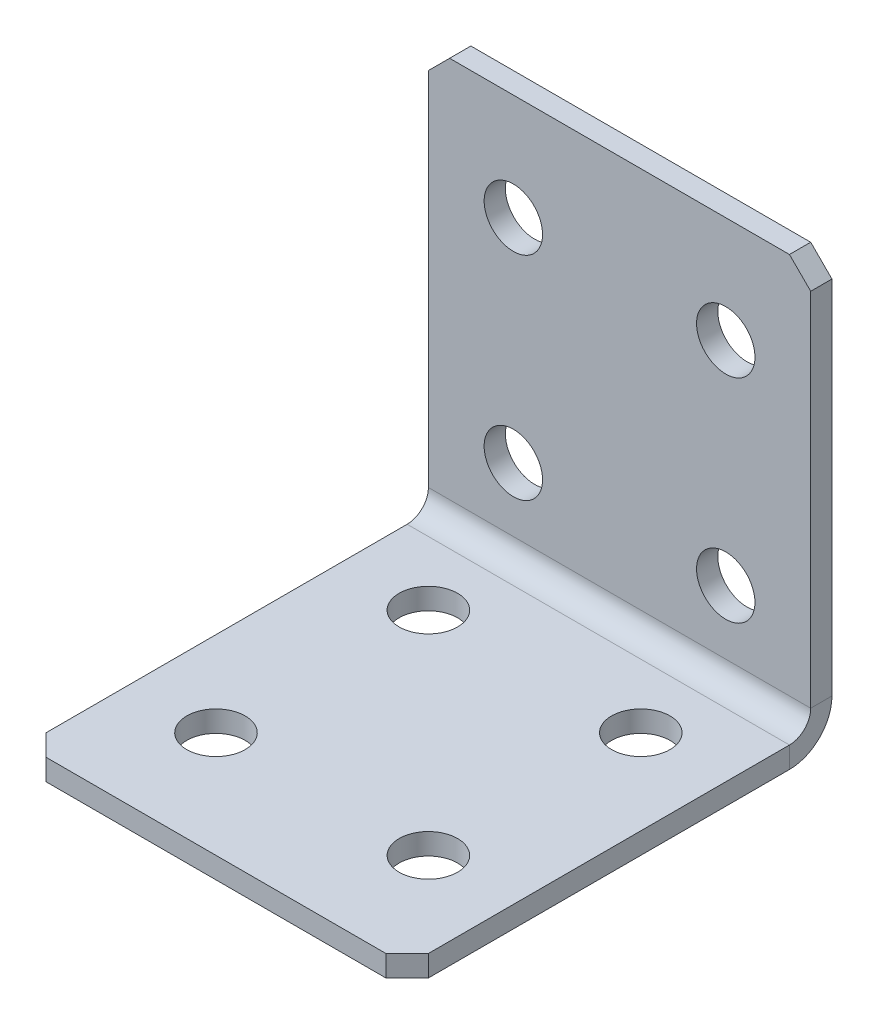
ISO-10303-21;
HEADER;
FILE_DESCRIPTION(('STEP AP214'),'2;1');
FILE_NAME('part.step','',(''),(''),'','','');
FILE_SCHEMA(('AUTOMOTIVE_DESIGN { 1 0 10303 214 1 1 1 1 }'));
ENDSEC;
DATA;
#1=APPLICATION_CONTEXT('core data for automotive mechanical design processes');
#2=APPLICATION_PROTOCOL_DEFINITION('international standard','automotive_design',2000,#1);
#3=PRODUCT_CONTEXT('',#1,'mechanical');
#4=PRODUCT('Part','Part','',(#3));
#5=PRODUCT_RELATED_PRODUCT_CATEGORY('part','',(#4));
#6=PRODUCT_DEFINITION_FORMATION('','',#4);
#7=PRODUCT_DEFINITION_CONTEXT('part definition',#1,'design');
#8=PRODUCT_DEFINITION('design','',#6,#7);
#9=PRODUCT_DEFINITION_SHAPE('','',#8);
#10=(LENGTH_UNIT() NAMED_UNIT(*) SI_UNIT(.MILLI.,.METRE.));
#11=(NAMED_UNIT(*) PLANE_ANGLE_UNIT() SI_UNIT($,.RADIAN.));
#12=(NAMED_UNIT(*) SI_UNIT($,.STERADIAN.) SOLID_ANGLE_UNIT());
#13=UNCERTAINTY_MEASURE_WITH_UNIT(LENGTH_MEASURE(1.E-05),#10,'distance_accuracy_value','');
#14=(GEOMETRIC_REPRESENTATION_CONTEXT(3) GLOBAL_UNCERTAINTY_ASSIGNED_CONTEXT((#13)) GLOBAL_UNIT_ASSIGNED_CONTEXT((#10,
#11,#12)) REPRESENTATION_CONTEXT('',''));
#15=CARTESIAN_POINT('',(0.,0.,0.));
#16=DIRECTION('',(0.,0.,1.));
#17=DIRECTION('',(1.,0.,0.));
#18=AXIS2_PLACEMENT_3D('',#15,#16,#17);
#19=CARTESIAN_POINT('',(0.,0.,2.));
#20=DIRECTION('',(0.,0.,-1.));
#21=DIRECTION('',(-1.,0.,0.));
#22=AXIS2_PLACEMENT_3D('',#19,#20,#21);
#23=PLANE('',#22);
#24=CARTESIAN_POINT('',(-10.,10.,2.));
#25=DIRECTION('',(0.,0.,1.));
#26=DIRECTION('',(1.,0.,0.));
#27=AXIS2_PLACEMENT_3D('',#24,#25,#26);
#28=CIRCLE('',#27,2.75);
#29=CARTESIAN_POINT('',(-7.25,10.,2.));
#30=VERTEX_POINT('',#29);
#31=EDGE_CURVE('E729',#30,#30,#28,.T.);
#32=ORIENTED_EDGE('',*,*,#31,.F.);
#33=EDGE_LOOP('',(#32));
#34=FACE_BOUND('',#33,.T.);
#35=CARTESIAN_POINT('',(10.,10.,2.));
#36=DIRECTION('',(0.,0.,1.));
#37=DIRECTION('',(1.,0.,0.));
#38=AXIS2_PLACEMENT_3D('',#35,#36,#37);
#39=CIRCLE('',#38,2.75);
#40=CARTESIAN_POINT('',(12.75,10.,2.));
#41=VERTEX_POINT('',#40);
#42=EDGE_CURVE('E746',#41,#41,#39,.T.);
#43=ORIENTED_EDGE('',*,*,#42,.F.);
#44=EDGE_LOOP('',(#43));
#45=FACE_BOUND('',#44,.T.);
#46=CARTESIAN_POINT('',(-10.,30.,2.));
#47=DIRECTION('',(0.,0.,1.));
#48=DIRECTION('',(1.,0.,0.));
#49=AXIS2_PLACEMENT_3D('',#46,#47,#48);
#50=CIRCLE('',#49,2.75);
#51=CARTESIAN_POINT('',(-7.25,30.,2.));
#52=VERTEX_POINT('',#51);
#53=EDGE_CURVE('E754',#52,#52,#50,.T.);
#54=ORIENTED_EDGE('',*,*,#53,.F.);
#55=EDGE_LOOP('',(#54));
#56=FACE_BOUND('',#55,.T.);
#57=DIRECTION('',(0.,1.,0.));
#58=VECTOR('',#57,1.);
#59=CARTESIAN_POINT('',(18.,0.,2.));
#60=LINE('',#59,#58);
#61=CARTESIAN_POINT('',(18.,3.99999999999999,2.));
#62=VERTEX_POINT('',#61);
#63=CARTESIAN_POINT('',(18.,38.,2.));
#64=VERTEX_POINT('',#63);
#65=EDGE_CURVE('E254',#62,#64,#60,.T.);
#66=ORIENTED_EDGE('',*,*,#65,.T.);
#67=DIRECTION('',(0.707106781186548,-0.707106781186548,0.));
#68=VECTOR('',#67,1.);
#69=CARTESIAN_POINT('',(18.,38.,2.));
#70=LINE('',#69,#68);
#71=CARTESIAN_POINT('',(16.,40.,2.));
#72=VERTEX_POINT('',#71);
#73=EDGE_CURVE('E303',#64,#72,#70,.F.);
#74=ORIENTED_EDGE('',*,*,#73,.T.);
#75=DIRECTION('',(-1.,0.,0.));
#76=VECTOR('',#75,1.);
#77=CARTESIAN_POINT('',(-18.,40.,2.));
#78=LINE('',#77,#76);
#79=CARTESIAN_POINT('',(-16.,40.,2.));
#80=VERTEX_POINT('',#79);
#81=EDGE_CURVE('E259',#72,#80,#78,.T.);
#82=ORIENTED_EDGE('',*,*,#81,.T.);
#83=DIRECTION('',(0.707106781186546,0.707106781186549,0.));
#84=VECTOR('',#83,1.);
#85=CARTESIAN_POINT('',(-16.,40.,2.));
#86=LINE('',#85,#84);
#87=CARTESIAN_POINT('',(-18.,38.,2.));
#88=VERTEX_POINT('',#87);
#89=EDGE_CURVE('E300',#80,#88,#86,.F.);
#90=ORIENTED_EDGE('',*,*,#89,.T.);
#91=DIRECTION('',(0.,-1.,0.));
#92=VECTOR('',#91,1.);
#93=CARTESIAN_POINT('',(-18.,0.,2.));
#94=LINE('',#93,#92);
#95=CARTESIAN_POINT('',(-18.,3.99999999999999,2.));
#96=VERTEX_POINT('',#95);
#97=EDGE_CURVE('E251',#88,#96,#94,.T.);
#98=ORIENTED_EDGE('',*,*,#97,.T.);
#99=DIRECTION('',(1.,0.,0.));
#100=VECTOR('',#99,1.);
#101=CARTESIAN_POINT('',(18.,3.99999999999999,2.));
#102=LINE('',#101,#100);
#103=EDGE_CURVE('E238',#62,#96,#102,.F.);
#104=ORIENTED_EDGE('',*,*,#103,.F.);
#105=EDGE_LOOP('',(#66,#74,#82,#90,#98,#104));
#106=FACE_BOUND('',#105,.T.);
#107=CARTESIAN_POINT('',(10.,30.,2.));
#108=DIRECTION('',(0.,0.,1.));
#109=DIRECTION('',(1.,0.,0.));
#110=AXIS2_PLACEMENT_3D('',#107,#108,#109);
#111=CIRCLE('',#110,2.75);
#112=CARTESIAN_POINT('',(12.75,30.,2.));
#113=VERTEX_POINT('',#112);
#114=EDGE_CURVE('E762',#113,#113,#111,.T.);
#115=ORIENTED_EDGE('',*,*,#114,.F.);
#116=EDGE_LOOP('',(#115));
#117=FACE_BOUND('',#116,.T.);
#118=ADVANCED_FACE('F70',(#34,#45,#56,#106,#117),#23,.F.);
#119=CARTESIAN_POINT('',(18.,0.,2.));
#120=DIRECTION('',(-1.,0.,0.));
#121=DIRECTION('',(0.,1.,0.));
#122=AXIS2_PLACEMENT_3D('',#119,#120,#121);
#123=PLANE('',#122);
#124=DIRECTION('',(0.,1.,0.));
#125=VECTOR('',#124,1.);
#126=CARTESIAN_POINT('',(18.,0.,0.));
#127=LINE('',#126,#125);
#128=CARTESIAN_POINT('',(18.,3.99999999999999,0.));
#129=VERTEX_POINT('',#128);
#130=CARTESIAN_POINT('',(18.,38.,0.));
#131=VERTEX_POINT('',#130);
#132=EDGE_CURVE('E266',#129,#131,#127,.T.);
#133=ORIENTED_EDGE('',*,*,#132,.T.);
#134=DIRECTION('',(0.,0.,-1.));
#135=VECTOR('',#134,1.);
#136=CARTESIAN_POINT('',(18.,38.,2.));
#137=LINE('',#136,#135);
#138=EDGE_CURVE('E296',#131,#64,#137,.F.);
#139=ORIENTED_EDGE('',*,*,#138,.T.);
#140=ORIENTED_EDGE('',*,*,#65,.F.);
#141=DIRECTION('',(0.,0.,-1.));
#142=VECTOR('',#141,1.);
#143=CARTESIAN_POINT('',(18.,3.99999999999999,2.));
#144=LINE('',#143,#142);
#145=EDGE_CURVE('E233',#62,#129,#144,.T.);
#146=ORIENTED_EDGE('',*,*,#145,.T.);
#147=EDGE_LOOP('',(#133,#139,#140,#146));
#148=FACE_BOUND('',#147,.T.);
#149=ADVANCED_FACE('F324',(#148),#123,.F.);
#150=CARTESIAN_POINT('',(0.,0.,0.));
#151=DIRECTION('',(0.,0.,-1.));
#152=DIRECTION('',(-1.,0.,0.));
#153=AXIS2_PLACEMENT_3D('',#150,#151,#152);
#154=PLANE('',#153);
#155=CARTESIAN_POINT('',(-10.,10.,0.));
#156=DIRECTION('',(0.,0.,-1.));
#157=DIRECTION('',(-1.,0.,0.));
#158=AXIS2_PLACEMENT_3D('',#155,#156,#157);
#159=CIRCLE('',#158,2.75);
#160=CARTESIAN_POINT('',(-12.75,10.,0.));
#161=VERTEX_POINT('',#160);
#162=EDGE_CURVE('E737',#161,#161,#159,.T.);
#163=ORIENTED_EDGE('',*,*,#162,.F.);
#164=EDGE_LOOP('',(#163));
#165=FACE_BOUND('',#164,.T.);
#166=CARTESIAN_POINT('',(10.,10.,0.));
#167=DIRECTION('',(0.,0.,-1.));
#168=DIRECTION('',(-1.,0.,0.));
#169=AXIS2_PLACEMENT_3D('',#166,#167,#168);
#170=CIRCLE('',#169,2.75);
#171=CARTESIAN_POINT('',(7.25,10.,0.));
#172=VERTEX_POINT('',#171);
#173=EDGE_CURVE('E750',#172,#172,#170,.T.);
#174=ORIENTED_EDGE('',*,*,#173,.F.);
#175=EDGE_LOOP('',(#174));
#176=FACE_BOUND('',#175,.T.);
#177=CARTESIAN_POINT('',(-10.,30.,0.));
#178=DIRECTION('',(0.,0.,-1.));
#179=DIRECTION('',(-1.,0.,0.));
#180=AXIS2_PLACEMENT_3D('',#177,#178,#179);
#181=CIRCLE('',#180,2.75);
#182=CARTESIAN_POINT('',(-12.75,30.,0.));
#183=VERTEX_POINT('',#182);
#184=EDGE_CURVE('E758',#183,#183,#181,.T.);
#185=ORIENTED_EDGE('',*,*,#184,.F.);
#186=EDGE_LOOP('',(#185));
#187=FACE_BOUND('',#186,.T.);
#188=CARTESIAN_POINT('',(10.,30.,0.));
#189=DIRECTION('',(0.,0.,-1.));
#190=DIRECTION('',(-1.,0.,0.));
#191=AXIS2_PLACEMENT_3D('',#188,#189,#190);
#192=CIRCLE('',#191,2.75);
#193=CARTESIAN_POINT('',(7.25,30.,0.));
#194=VERTEX_POINT('',#193);
#195=EDGE_CURVE('E228',#194,#194,#192,.T.);
#196=ORIENTED_EDGE('',*,*,#195,.F.);
#197=EDGE_LOOP('',(#196));
#198=FACE_BOUND('',#197,.T.);
#199=DIRECTION('',(-1.,0.,0.));
#200=VECTOR('',#199,1.);
#201=CARTESIAN_POINT('',(0.,40.,0.));
#202=LINE('',#201,#200);
#203=CARTESIAN_POINT('',(16.,40.,0.));
#204=VERTEX_POINT('',#203);
#205=CARTESIAN_POINT('',(-16.,40.,0.));
#206=VERTEX_POINT('',#205);
#207=EDGE_CURVE('E255',#204,#206,#202,.T.);
#208=ORIENTED_EDGE('',*,*,#207,.F.);
#209=DIRECTION('',(-0.707106781186548,0.707106781186548,0.));
#210=VECTOR('',#209,1.);
#211=CARTESIAN_POINT('',(28.,28.,0.));
#212=LINE('',#211,#210);
#213=EDGE_CURVE('E80',#204,#131,#212,.F.);
#214=ORIENTED_EDGE('',*,*,#213,.T.);
#215=ORIENTED_EDGE('',*,*,#132,.F.);
#216=DIRECTION('',(1.,0.,0.));
#217=VECTOR('',#216,1.);
#218=CARTESIAN_POINT('',(18.,3.99999999999999,0.));
#219=LINE('',#218,#217);
#220=CARTESIAN_POINT('',(-18.,4.00000000000001,0.));
#221=VERTEX_POINT('',#220);
#222=EDGE_CURVE('E169',#129,#221,#219,.F.);
#223=ORIENTED_EDGE('',*,*,#222,.T.);
#224=DIRECTION('',(0.,1.,0.));
#225=VECTOR('',#224,1.);
#226=CARTESIAN_POINT('',(-18.,0.,0.));
#227=LINE('',#226,#225);
#228=CARTESIAN_POINT('',(-18.,38.,0.));
#229=VERTEX_POINT('',#228);
#230=EDGE_CURVE('E248',#229,#221,#227,.F.);
#231=ORIENTED_EDGE('',*,*,#230,.F.);
#232=DIRECTION('',(-0.707106781186546,-0.707106781186549,0.));
#233=VECTOR('',#232,1.);
#234=CARTESIAN_POINT('',(-28.,27.9999999999999,0.));
#235=LINE('',#234,#233);
#236=EDGE_CURVE('E92',#229,#206,#235,.F.);
#237=ORIENTED_EDGE('',*,*,#236,.T.);
#238=EDGE_LOOP('',(#208,#214,#215,#223,#231,#237));
#239=FACE_BOUND('',#238,.T.);
#240=ADVANCED_FACE('F319',(#165,#176,#187,#198,#239),#154,.T.);
#241=CARTESIAN_POINT('',(-18.,40.,2.));
#242=DIRECTION('',(0.,-1.,0.));
#243=DIRECTION('',(-1.,0.,0.));
#244=AXIS2_PLACEMENT_3D('',#241,#242,#243);
#245=PLANE('',#244);
#246=ORIENTED_EDGE('',*,*,#81,.F.);
#247=DIRECTION('',(0.,0.,1.));
#248=VECTOR('',#247,1.);
#249=CARTESIAN_POINT('',(16.,40.,2.));
#250=LINE('',#249,#248);
#251=EDGE_CURVE('E310',#72,#204,#250,.F.);
#252=ORIENTED_EDGE('',*,*,#251,.T.);
#253=ORIENTED_EDGE('',*,*,#207,.T.);
#254=DIRECTION('',(0.,0.,-1.));
#255=VECTOR('',#254,1.);
#256=CARTESIAN_POINT('',(-16.,40.,2.));
#257=LINE('',#256,#255);
#258=EDGE_CURVE('E306',#206,#80,#257,.F.);
#259=ORIENTED_EDGE('',*,*,#258,.T.);
#260=EDGE_LOOP('',(#246,#252,#253,#259));
#261=FACE_BOUND('',#260,.T.);
#262=ADVANCED_FACE('F332',(#261),#245,.F.);
#263=CARTESIAN_POINT('',(-18.,0.,2.));
#264=DIRECTION('',(1.,0.,0.));
#265=DIRECTION('',(0.,-1.,0.));
#266=AXIS2_PLACEMENT_3D('',#263,#264,#265);
#267=PLANE('',#266);
#268=ORIENTED_EDGE('',*,*,#97,.F.);
#269=DIRECTION('',(0.,0.,1.));
#270=VECTOR('',#269,1.);
#271=CARTESIAN_POINT('',(-18.,38.,2.));
#272=LINE('',#271,#270);
#273=EDGE_CURVE('E13',#88,#229,#272,.F.);
#274=ORIENTED_EDGE('',*,*,#273,.T.);
#275=ORIENTED_EDGE('',*,*,#230,.T.);
#276=DIRECTION('',(0.,0.,-1.));
#277=VECTOR('',#276,1.);
#278=CARTESIAN_POINT('',(-18.,3.99999999999999,2.));
#279=LINE('',#278,#277);
#280=EDGE_CURVE('E244',#96,#221,#279,.T.);
#281=ORIENTED_EDGE('',*,*,#280,.F.);
#282=EDGE_LOOP('',(#268,#274,#275,#281));
#283=FACE_BOUND('',#282,.T.);
#284=ADVANCED_FACE('F336',(#283),#267,.F.);
#285=CARTESIAN_POINT('',(-18.,3.99999999999999,4.));
#286=DIRECTION('',(-1.,0.,0.));
#287=DIRECTION('',(0.,0.,1.));
#288=AXIS2_PLACEMENT_3D('',#285,#286,#287);
#289=PLANE('',#288);
#290=DIRECTION('',(0.,1.,0.));
#291=VECTOR('',#290,1.);
#292=CARTESIAN_POINT('',(-18.,0.,3.99999999999999));
#293=LINE('',#292,#291);
#294=CARTESIAN_POINT('',(-18.,1.99999999999999,3.99999999999999));
#295=VERTEX_POINT('',#294);
#296=CARTESIAN_POINT('',(-18.,0.,3.99999999999999));
#297=VERTEX_POINT('',#296);
#298=EDGE_CURVE('E224',#295,#297,#293,.F.);
#299=ORIENTED_EDGE('',*,*,#298,.F.);
#300=CARTESIAN_POINT('',(-18.,3.99999999999999,4.));
#301=DIRECTION('',(1.,0.,0.));
#302=DIRECTION('',(0.,0.,-1.));
#303=AXIS2_PLACEMENT_3D('',#300,#301,#302);
#304=CIRCLE('',#303,2.);
#305=EDGE_CURVE('E173',#96,#295,#304,.F.);
#306=ORIENTED_EDGE('',*,*,#305,.F.);
#307=ORIENTED_EDGE('',*,*,#280,.T.);
#308=CARTESIAN_POINT('',(-18.,3.99999999999999,4.));
#309=DIRECTION('',(1.,0.,0.));
#310=DIRECTION('',(0.,0.,-1.));
#311=AXIS2_PLACEMENT_3D('',#308,#309,#310);
#312=CIRCLE('',#311,4.);
#313=EDGE_CURVE('E231',#221,#297,#312,.F.);
#314=ORIENTED_EDGE('',*,*,#313,.T.);
#315=EDGE_LOOP('',(#299,#306,#307,#314));
#316=FACE_BOUND('',#315,.T.);
#317=ADVANCED_FACE('F340',(#316),#289,.T.);
#318=CARTESIAN_POINT('',(18.,3.99999999999999,4.));
#319=DIRECTION('',(-1.,0.,0.));
#320=DIRECTION('',(0.,0.,1.));
#321=AXIS2_PLACEMENT_3D('',#318,#319,#320);
#322=PLANE('',#321);
#323=CARTESIAN_POINT('',(18.,3.99999999999999,4.));
#324=DIRECTION('',(1.,0.,0.));
#325=DIRECTION('',(0.,0.,-1.));
#326=AXIS2_PLACEMENT_3D('',#323,#324,#325);
#327=CIRCLE('',#326,2.);
#328=CARTESIAN_POINT('',(18.,1.99999999999999,3.99999999999999));
#329=VERTEX_POINT('',#328);
#330=EDGE_CURVE('E180',#329,#62,#327,.T.);
#331=ORIENTED_EDGE('',*,*,#330,.F.);
#332=DIRECTION('',(0.,1.,0.));
#333=VECTOR('',#332,1.);
#334=CARTESIAN_POINT('',(18.,1.99999999999999,3.99999999999999));
#335=LINE('',#334,#333);
#336=CARTESIAN_POINT('',(18.,0.,3.99999999999999));
#337=VERTEX_POINT('',#336);
#338=EDGE_CURVE('E177',#329,#337,#335,.F.);
#339=ORIENTED_EDGE('',*,*,#338,.T.);
#340=CARTESIAN_POINT('',(18.,3.99999999999999,4.));
#341=DIRECTION('',(1.,0.,0.));
#342=DIRECTION('',(0.,0.,-1.));
#343=AXIS2_PLACEMENT_3D('',#340,#341,#342);
#344=CIRCLE('',#343,4.);
#345=EDGE_CURVE('E161',#337,#129,#344,.T.);
#346=ORIENTED_EDGE('',*,*,#345,.T.);
#347=ORIENTED_EDGE('',*,*,#145,.F.);
#348=EDGE_LOOP('',(#331,#339,#346,#347));
#349=FACE_BOUND('',#348,.T.);
#350=ADVANCED_FACE('F178',(#349),#322,.F.);
#351=CARTESIAN_POINT('',(18.,3.99999999999999,4.));
#352=DIRECTION('',(1.,0.,0.));
#353=DIRECTION('',(0.,-1.,0.));
#354=AXIS2_PLACEMENT_3D('',#351,#352,#353);
#355=CYLINDRICAL_SURFACE('',#354,4.);
#356=ORIENTED_EDGE('',*,*,#222,.F.);
#357=ORIENTED_EDGE('',*,*,#345,.F.);
#358=DIRECTION('',(1.,0.,0.));
#359=VECTOR('',#358,1.);
#360=CARTESIAN_POINT('',(-18.,0.,3.99999999999999));
#361=LINE('',#360,#359);
#362=EDGE_CURVE('E166',#337,#297,#361,.F.);
#363=ORIENTED_EDGE('',*,*,#362,.T.);
#364=ORIENTED_EDGE('',*,*,#313,.F.);
#365=EDGE_LOOP('',(#356,#357,#363,#364));
#366=FACE_BOUND('',#365,.T.);
#367=ADVANCED_FACE('F163',(#366),#355,.T.);
#368=CARTESIAN_POINT('',(18.,3.99999999999999,4.));
#369=DIRECTION('',(1.,0.,0.));
#370=DIRECTION('',(0.,-1.,0.));
#371=AXIS2_PLACEMENT_3D('',#368,#369,#370);
#372=CYLINDRICAL_SURFACE('',#371,2.);
#373=ORIENTED_EDGE('',*,*,#103,.T.);
#374=ORIENTED_EDGE('',*,*,#305,.T.);
#375=DIRECTION('',(1.,0.,0.));
#376=VECTOR('',#375,1.);
#377=CARTESIAN_POINT('',(-18.,1.99999999999999,3.99999999999999));
#378=LINE('',#377,#376);
#379=EDGE_CURVE('E186',#295,#329,#378,.T.);
#380=ORIENTED_EDGE('',*,*,#379,.T.);
#381=ORIENTED_EDGE('',*,*,#330,.T.);
#382=EDGE_LOOP('',(#373,#374,#380,#381));
#383=FACE_BOUND('',#382,.T.);
#384=ADVANCED_FACE('F343',(#383),#372,.F.);
#385=CARTESIAN_POINT('',(-18.,0.,1.99999999999999));
#386=DIRECTION('',(1.,0.,0.));
#387=DIRECTION('',(0.,0.,-1.));
#388=AXIS2_PLACEMENT_3D('',#385,#386,#387);
#389=PLANE('',#388);
#390=DIRECTION('',(0.,0.,-1.));
#391=VECTOR('',#390,1.);
#392=CARTESIAN_POINT('',(-18.,0.,0.));
#393=LINE('',#392,#391);
#394=CARTESIAN_POINT('',(-18.,-1.25737396972132E-13,38.));
#395=VERTEX_POINT('',#394);
#396=EDGE_CURVE('E194',#395,#297,#393,.T.);
#397=ORIENTED_EDGE('',*,*,#396,.F.);
#398=DIRECTION('',(0.,1.,0.));
#399=VECTOR('',#398,1.);
#400=CARTESIAN_POINT('',(-18.,-1.25693328198353E-13,38.));
#401=LINE('',#400,#399);
#402=CARTESIAN_POINT('',(-18.,1.99999999999987,38.));
#403=VERTEX_POINT('',#402);
#404=EDGE_CURVE('E292',#395,#403,#401,.T.);
#405=ORIENTED_EDGE('',*,*,#404,.T.);
#406=DIRECTION('',(0.,0.,1.));
#407=VECTOR('',#406,1.);
#408=CARTESIAN_POINT('',(-18.,2.,2.));
#409=LINE('',#408,#407);
#410=EDGE_CURVE('E196',#403,#295,#409,.F.);
#411=ORIENTED_EDGE('',*,*,#410,.T.);
#412=ORIENTED_EDGE('',*,*,#298,.T.);
#413=EDGE_LOOP('',(#397,#405,#411,#412));
#414=FACE_BOUND('',#413,.T.);
#415=ADVANCED_FACE('F360',(#414),#389,.F.);
#416=CARTESIAN_POINT('',(18.,-1.32706345912226E-13,40.));
#417=DIRECTION('',(-1.,0.,0.));
#418=DIRECTION('',(0.,0.,1.));
#419=AXIS2_PLACEMENT_3D('',#416,#417,#418);
#420=PLANE('',#419);
#421=DIRECTION('',(0.,0.,-1.));
#422=VECTOR('',#421,1.);
#423=CARTESIAN_POINT('',(18.,1.99999999999987,40.));
#424=LINE('',#423,#422);
#425=CARTESIAN_POINT('',(18.,1.99999999999987,38.));
#426=VERTEX_POINT('',#425);
#427=EDGE_CURVE('E217',#329,#426,#424,.F.);
#428=ORIENTED_EDGE('',*,*,#427,.T.);
#429=DIRECTION('',(0.,-1.,0.));
#430=VECTOR('',#429,1.);
#431=CARTESIAN_POINT('',(18.,-1.25723383234539E-13,38.));
#432=LINE('',#431,#430);
#433=CARTESIAN_POINT('',(18.,-1.25737396972132E-13,38.));
#434=VERTEX_POINT('',#433);
#435=EDGE_CURVE('E200',#426,#434,#432,.T.);
#436=ORIENTED_EDGE('',*,*,#435,.T.);
#437=DIRECTION('',(0.,0.,1.));
#438=VECTOR('',#437,1.);
#439=CARTESIAN_POINT('',(18.,0.,0.));
#440=LINE('',#439,#438);
#441=EDGE_CURVE('E191',#337,#434,#440,.T.);
#442=ORIENTED_EDGE('',*,*,#441,.F.);
#443=ORIENTED_EDGE('',*,*,#338,.F.);
#444=EDGE_LOOP('',(#428,#436,#442,#443));
#445=FACE_BOUND('',#444,.T.);
#446=ADVANCED_FACE('F198',(#445),#420,.F.);
#447=CARTESIAN_POINT('',(0.,0.,0.));
#448=DIRECTION('',(0.,1.,0.));
#449=DIRECTION('',(0.,0.,1.));
#450=AXIS2_PLACEMENT_3D('',#447,#448,#449);
#451=PLANE('',#450);
#452=CARTESIAN_POINT('',(-10.,0.,10.));
#453=DIRECTION('',(0.,1.,0.));
#454=DIRECTION('',(0.,0.,1.));
#455=AXIS2_PLACEMENT_3D('',#452,#453,#454);
#456=CIRCLE('',#455,2.74999999999999);
#457=CARTESIAN_POINT('',(-10.,0.,12.75));
#458=VERTEX_POINT('',#457);
#459=EDGE_CURVE('E716',#458,#458,#456,.T.);
#460=ORIENTED_EDGE('',*,*,#459,.T.);
#461=EDGE_LOOP('',(#460));
#462=FACE_BOUND('',#461,.T.);
#463=CARTESIAN_POINT('',(10.,0.,10.));
#464=DIRECTION('',(0.,1.,0.));
#465=DIRECTION('',(0.,0.,1.));
#466=AXIS2_PLACEMENT_3D('',#463,#464,#465);
#467=CIRCLE('',#466,2.74999999999999);
#468=CARTESIAN_POINT('',(10.,0.,12.75));
#469=VERTEX_POINT('',#468);
#470=EDGE_CURVE('E720',#469,#469,#467,.T.);
#471=ORIENTED_EDGE('',*,*,#470,.T.);
#472=EDGE_LOOP('',(#471));
#473=FACE_BOUND('',#472,.T.);
#474=CARTESIAN_POINT('',(-10.,0.,30.));
#475=DIRECTION('',(0.,1.,0.));
#476=DIRECTION('',(0.,0.,1.));
#477=AXIS2_PLACEMENT_3D('',#474,#475,#476);
#478=CIRCLE('',#477,2.74999999999999);
#479=CARTESIAN_POINT('',(-10.,-1.07613450074508E-13,32.75));
#480=VERTEX_POINT('',#479);
#481=EDGE_CURVE('E724',#480,#480,#478,.T.);
#482=ORIENTED_EDGE('',*,*,#481,.T.);
#483=EDGE_LOOP('',(#482));
#484=FACE_BOUND('',#483,.T.);
#485=CARTESIAN_POINT('',(10.,0.,30.));
#486=DIRECTION('',(0.,1.,0.));
#487=DIRECTION('',(0.,0.,1.));
#488=AXIS2_PLACEMENT_3D('',#485,#486,#487);
#489=CIRCLE('',#488,2.74999999999999);
#490=CARTESIAN_POINT('',(10.,-1.07613450074508E-13,32.75));
#491=VERTEX_POINT('',#490);
#492=EDGE_CURVE('E727',#491,#491,#489,.T.);
#493=ORIENTED_EDGE('',*,*,#492,.T.);
#494=EDGE_LOOP('',(#493));
#495=FACE_BOUND('',#494,.T.);
#496=ORIENTED_EDGE('',*,*,#441,.T.);
#497=DIRECTION('',(0.707106781186546,0.,-0.707106781186549));
#498=VECTOR('',#497,1.);
#499=CARTESIAN_POINT('',(16.,-1.32706345912226E-13,40.));
#500=LINE('',#499,#498);
#501=CARTESIAN_POINT('',(16.,-1.32720359649818E-13,40.));
#502=VERTEX_POINT('',#501);
#503=EDGE_CURVE('E289',#434,#502,#500,.F.);
#504=ORIENTED_EDGE('',*,*,#503,.T.);
#505=DIRECTION('',(-1.,0.,0.));
#506=VECTOR('',#505,1.);
#507=CARTESIAN_POINT('',(0.,-1.32720359649818E-13,40.));
#508=LINE('',#507,#506);
#509=CARTESIAN_POINT('',(-16.,-1.32720359649818E-13,40.));
#510=VERTEX_POINT('',#509);
#511=EDGE_CURVE('E202',#502,#510,#508,.T.);
#512=ORIENTED_EDGE('',*,*,#511,.T.);
#513=DIRECTION('',(0.707106781186549,0.,0.707106781186546));
#514=VECTOR('',#513,1.);
#515=CARTESIAN_POINT('',(-18.,-1.25693328198353E-13,38.));
#516=LINE('',#515,#514);
#517=EDGE_CURVE('E286',#510,#395,#516,.F.);
#518=ORIENTED_EDGE('',*,*,#517,.T.);
#519=ORIENTED_EDGE('',*,*,#396,.T.);
#520=ORIENTED_EDGE('',*,*,#362,.F.);
#521=EDGE_LOOP('',(#496,#504,#512,#518,#519,#520));
#522=FACE_BOUND('',#521,.T.);
#523=ADVANCED_FACE('F190',(#462,#473,#484,#495,#522),#451,.F.);
#524=CARTESIAN_POINT('',(0.,2.00000000000001,0.));
#525=DIRECTION('',(0.,1.,0.));
#526=DIRECTION('',(0.,0.,1.));
#527=AXIS2_PLACEMENT_3D('',#524,#525,#526);
#528=PLANE('',#527);
#529=CARTESIAN_POINT('',(-10.,1.99999999999997,10.));
#530=DIRECTION('',(0.,1.,0.));
#531=DIRECTION('',(0.,0.,1.));
#532=AXIS2_PLACEMENT_3D('',#529,#530,#531);
#533=CIRCLE('',#532,2.74999999999999);
#534=CARTESIAN_POINT('',(-10.,1.99999999999996,12.75));
#535=VERTEX_POINT('',#534);
#536=EDGE_CURVE('E874',#535,#535,#533,.T.);
#537=ORIENTED_EDGE('',*,*,#536,.F.);
#538=EDGE_LOOP('',(#537));
#539=FACE_BOUND('',#538,.T.);
#540=CARTESIAN_POINT('',(10.,1.99999999999997,10.));
#541=DIRECTION('',(0.,1.,0.));
#542=DIRECTION('',(0.,0.,1.));
#543=AXIS2_PLACEMENT_3D('',#540,#541,#542);
#544=CIRCLE('',#543,2.74999999999999);
#545=CARTESIAN_POINT('',(10.,1.99999999999996,12.75));
#546=VERTEX_POINT('',#545);
#547=EDGE_CURVE('E800',#546,#546,#544,.T.);
#548=ORIENTED_EDGE('',*,*,#547,.F.);
#549=EDGE_LOOP('',(#548));
#550=FACE_BOUND('',#549,.T.);
#551=CARTESIAN_POINT('',(-10.,1.9999999999999,30.));
#552=DIRECTION('',(0.,1.,0.));
#553=DIRECTION('',(0.,0.,1.));
#554=AXIS2_PLACEMENT_3D('',#551,#552,#553);
#555=CIRCLE('',#554,2.74999999999999);
#556=CARTESIAN_POINT('',(-10.,1.99999999999989,32.75));
#557=VERTEX_POINT('',#556);
#558=EDGE_CURVE('E813',#557,#557,#555,.T.);
#559=ORIENTED_EDGE('',*,*,#558,.F.);
#560=EDGE_LOOP('',(#559));
#561=FACE_BOUND('',#560,.T.);
#562=CARTESIAN_POINT('',(10.,1.9999999999999,30.));
#563=DIRECTION('',(0.,1.,0.));
#564=DIRECTION('',(0.,0.,1.));
#565=AXIS2_PLACEMENT_3D('',#562,#563,#564);
#566=CIRCLE('',#565,2.74999999999999);
#567=CARTESIAN_POINT('',(10.,1.99999999999989,32.75));
#568=VERTEX_POINT('',#567);
#569=EDGE_CURVE('E730',#568,#568,#566,.T.);
#570=ORIENTED_EDGE('',*,*,#569,.F.);
#571=EDGE_LOOP('',(#570));
#572=FACE_BOUND('',#571,.T.);
#573=DIRECTION('',(1.,0.,0.));
#574=VECTOR('',#573,1.);
#575=CARTESIAN_POINT('',(-18.,1.99999999999987,40.));
#576=LINE('',#575,#574);
#577=CARTESIAN_POINT('',(16.,1.99999999999987,40.));
#578=VERTEX_POINT('',#577);
#579=CARTESIAN_POINT('',(-16.,1.99999999999987,40.));
#580=VERTEX_POINT('',#579);
#581=EDGE_CURVE('E210',#578,#580,#576,.F.);
#582=ORIENTED_EDGE('',*,*,#581,.F.);
#583=DIRECTION('',(-0.707106781186546,0.,0.707106781186549));
#584=VECTOR('',#583,1.);
#585=CARTESIAN_POINT('',(28.,1.99999999999991,27.9999999999999));
#586=LINE('',#585,#584);
#587=EDGE_CURVE('E281',#578,#426,#586,.F.);
#588=ORIENTED_EDGE('',*,*,#587,.T.);
#589=ORIENTED_EDGE('',*,*,#427,.F.);
#590=ORIENTED_EDGE('',*,*,#379,.F.);
#591=ORIENTED_EDGE('',*,*,#410,.F.);
#592=DIRECTION('',(-0.707106781186549,0.,-0.707106781186546));
#593=VECTOR('',#592,1.);
#594=CARTESIAN_POINT('',(-28.,1.99999999999991,28.0000000000001));
#595=LINE('',#594,#593);
#596=EDGE_CURVE('E278',#403,#580,#595,.F.);
#597=ORIENTED_EDGE('',*,*,#596,.T.);
#598=EDGE_LOOP('',(#582,#588,#589,#590,#591,#597));
#599=FACE_BOUND('',#598,.T.);
#600=ADVANCED_FACE('F347',(#539,#550,#561,#572,#599),#528,.T.);
#601=CARTESIAN_POINT('',(-18.,-1.32706345912226E-13,40.));
#602=DIRECTION('',(0.,0.,-1.));
#603=DIRECTION('',(0.,1.,0.));
#604=AXIS2_PLACEMENT_3D('',#601,#602,#603);
#605=PLANE('',#604);
#606=ORIENTED_EDGE('',*,*,#511,.F.);
#607=DIRECTION('',(0.,1.,0.));
#608=VECTOR('',#607,1.);
#609=CARTESIAN_POINT('',(16.,-1.32706345912226E-13,40.));
#610=LINE('',#609,#608);
#611=EDGE_CURVE('E274',#502,#578,#610,.T.);
#612=ORIENTED_EDGE('',*,*,#611,.T.);
#613=ORIENTED_EDGE('',*,*,#581,.T.);
#614=DIRECTION('',(0.,-1.,0.));
#615=VECTOR('',#614,1.);
#616=CARTESIAN_POINT('',(-16.,-1.32706345912226E-13,40.));
#617=LINE('',#616,#615);
#618=EDGE_CURVE('E263',#580,#510,#617,.T.);
#619=ORIENTED_EDGE('',*,*,#618,.T.);
#620=EDGE_LOOP('',(#606,#612,#613,#619));
#621=FACE_BOUND('',#620,.T.);
#622=ADVANCED_FACE('F354',(#621),#605,.F.);
#623=CARTESIAN_POINT('',(10.,30.,2.));
#624=DIRECTION('',(0.,0.,1.));
#625=DIRECTION('',(1.,0.,0.));
#626=AXIS2_PLACEMENT_3D('',#623,#624,#625);
#627=CYLINDRICAL_SURFACE('',#626,2.75);
#628=ORIENTED_EDGE('',*,*,#114,.T.);
#629=EDGE_LOOP('',(#628));
#630=FACE_BOUND('',#629,.T.);
#631=ORIENTED_EDGE('',*,*,#195,.T.);
#632=EDGE_LOOP('',(#631));
#633=FACE_BOUND('',#632,.T.);
#634=ADVANCED_FACE('F483',(#630,#633),#627,.F.);
#635=CARTESIAN_POINT('',(-10.,30.,2.));
#636=DIRECTION('',(0.,0.,1.));
#637=DIRECTION('',(1.,0.,0.));
#638=AXIS2_PLACEMENT_3D('',#635,#636,#637);
#639=CYLINDRICAL_SURFACE('',#638,2.75);
#640=ORIENTED_EDGE('',*,*,#53,.T.);
#641=EDGE_LOOP('',(#640));
#642=FACE_BOUND('',#641,.T.);
#643=ORIENTED_EDGE('',*,*,#184,.T.);
#644=EDGE_LOOP('',(#643));
#645=FACE_BOUND('',#644,.T.);
#646=ADVANCED_FACE('F474',(#642,#645),#639,.F.);
#647=CARTESIAN_POINT('',(10.,10.,2.));
#648=DIRECTION('',(0.,0.,1.));
#649=DIRECTION('',(1.,0.,0.));
#650=AXIS2_PLACEMENT_3D('',#647,#648,#649);
#651=CYLINDRICAL_SURFACE('',#650,2.75);
#652=ORIENTED_EDGE('',*,*,#42,.T.);
#653=EDGE_LOOP('',(#652));
#654=FACE_BOUND('',#653,.T.);
#655=ORIENTED_EDGE('',*,*,#173,.T.);
#656=EDGE_LOOP('',(#655));
#657=FACE_BOUND('',#656,.T.);
#658=ADVANCED_FACE('F465',(#654,#657),#651,.F.);
#659=CARTESIAN_POINT('',(-10.,10.,2.));
#660=DIRECTION('',(0.,0.,1.));
#661=DIRECTION('',(1.,0.,0.));
#662=AXIS2_PLACEMENT_3D('',#659,#660,#661);
#663=CYLINDRICAL_SURFACE('',#662,2.75);
#664=ORIENTED_EDGE('',*,*,#31,.T.);
#665=EDGE_LOOP('',(#664));
#666=FACE_BOUND('',#665,.T.);
#667=ORIENTED_EDGE('',*,*,#162,.T.);
#668=EDGE_LOOP('',(#667));
#669=FACE_BOUND('',#668,.T.);
#670=ADVANCED_FACE('F456',(#666,#669),#663,.F.);
#671=CARTESIAN_POINT('',(10.,1.9999999999999,30.));
#672=DIRECTION('',(0.,1.,0.));
#673=DIRECTION('',(0.,0.,1.));
#674=AXIS2_PLACEMENT_3D('',#671,#672,#673);
#675=CYLINDRICAL_SURFACE('',#674,2.74999999999999);
#676=ORIENTED_EDGE('',*,*,#492,.F.);
#677=EDGE_LOOP('',(#676));
#678=FACE_BOUND('',#677,.T.);
#679=ORIENTED_EDGE('',*,*,#569,.T.);
#680=EDGE_LOOP('',(#679));
#681=FACE_BOUND('',#680,.T.);
#682=ADVANCED_FACE('F447',(#678,#681),#675,.F.);
#683=CARTESIAN_POINT('',(-10.,1.9999999999999,30.));
#684=DIRECTION('',(0.,1.,0.));
#685=DIRECTION('',(0.,0.,1.));
#686=AXIS2_PLACEMENT_3D('',#683,#684,#685);
#687=CYLINDRICAL_SURFACE('',#686,2.74999999999999);
#688=ORIENTED_EDGE('',*,*,#481,.F.);
#689=EDGE_LOOP('',(#688));
#690=FACE_BOUND('',#689,.T.);
#691=ORIENTED_EDGE('',*,*,#558,.T.);
#692=EDGE_LOOP('',(#691));
#693=FACE_BOUND('',#692,.T.);
#694=ADVANCED_FACE('F438',(#690,#693),#687,.F.);
#695=CARTESIAN_POINT('',(10.,1.99999999999997,10.));
#696=DIRECTION('',(0.,1.,0.));
#697=DIRECTION('',(0.,0.,1.));
#698=AXIS2_PLACEMENT_3D('',#695,#696,#697);
#699=CYLINDRICAL_SURFACE('',#698,2.74999999999999);
#700=ORIENTED_EDGE('',*,*,#470,.F.);
#701=EDGE_LOOP('',(#700));
#702=FACE_BOUND('',#701,.T.);
#703=ORIENTED_EDGE('',*,*,#547,.T.);
#704=EDGE_LOOP('',(#703));
#705=FACE_BOUND('',#704,.T.);
#706=ADVANCED_FACE('F429',(#702,#705),#699,.F.);
#707=CARTESIAN_POINT('',(-10.,1.99999999999997,10.));
#708=DIRECTION('',(0.,1.,0.));
#709=DIRECTION('',(0.,0.,1.));
#710=AXIS2_PLACEMENT_3D('',#707,#708,#709);
#711=CYLINDRICAL_SURFACE('',#710,2.74999999999999);
#712=ORIENTED_EDGE('',*,*,#459,.F.);
#713=EDGE_LOOP('',(#712));
#714=FACE_BOUND('',#713,.T.);
#715=ORIENTED_EDGE('',*,*,#536,.T.);
#716=EDGE_LOOP('',(#715));
#717=FACE_BOUND('',#716,.T.);
#718=ADVANCED_FACE('F395',(#714,#717),#711,.F.);
#719=CARTESIAN_POINT('',(16.,-1.32706345912226E-13,40.));
#720=DIRECTION('',(-0.707106781186549,0.,-0.707106781186546));
#721=DIRECTION('',(0.,1.,0.));
#722=AXIS2_PLACEMENT_3D('',#719,#720,#721);
#723=PLANE('',#722);
#724=ORIENTED_EDGE('',*,*,#503,.F.);
#725=ORIENTED_EDGE('',*,*,#435,.F.);
#726=ORIENTED_EDGE('',*,*,#587,.F.);
#727=ORIENTED_EDGE('',*,*,#611,.F.);
#728=EDGE_LOOP('',(#724,#725,#726,#727));
#729=FACE_BOUND('',#728,.T.);
#730=ADVANCED_FACE('F349',(#729),#723,.F.);
#731=CARTESIAN_POINT('',(-18.,-1.25693328198353E-13,38.));
#732=DIRECTION('',(0.707106781186546,0.,-0.707106781186549));
#733=DIRECTION('',(0.,1.,0.));
#734=AXIS2_PLACEMENT_3D('',#731,#732,#733);
#735=PLANE('',#734);
#736=ORIENTED_EDGE('',*,*,#517,.F.);
#737=ORIENTED_EDGE('',*,*,#618,.F.);
#738=ORIENTED_EDGE('',*,*,#596,.F.);
#739=ORIENTED_EDGE('',*,*,#404,.F.);
#740=EDGE_LOOP('',(#736,#737,#738,#739));
#741=FACE_BOUND('',#740,.T.);
#742=ADVANCED_FACE('F357',(#741),#735,.F.);
#743=CARTESIAN_POINT('',(18.,38.,2.));
#744=DIRECTION('',(-0.707106781186548,-0.707106781186548,0.));
#745=DIRECTION('',(0.,0.,1.));
#746=AXIS2_PLACEMENT_3D('',#743,#744,#745);
#747=PLANE('',#746);
#748=ORIENTED_EDGE('',*,*,#213,.F.);
#749=ORIENTED_EDGE('',*,*,#251,.F.);
#750=ORIENTED_EDGE('',*,*,#73,.F.);
#751=ORIENTED_EDGE('',*,*,#138,.F.);
#752=EDGE_LOOP('',(#748,#749,#750,#751));
#753=FACE_BOUND('',#752,.T.);
#754=ADVANCED_FACE('F326',(#753),#747,.F.);
#755=CARTESIAN_POINT('',(-16.,40.,2.));
#756=DIRECTION('',(0.707106781186549,-0.707106781186546,0.));
#757=DIRECTION('',(0.,0.,1.));
#758=AXIS2_PLACEMENT_3D('',#755,#756,#757);
#759=PLANE('',#758);
#760=ORIENTED_EDGE('',*,*,#236,.F.);
#761=ORIENTED_EDGE('',*,*,#273,.F.);
#762=ORIENTED_EDGE('',*,*,#89,.F.);
#763=ORIENTED_EDGE('',*,*,#258,.F.);
#764=EDGE_LOOP('',(#760,#761,#762,#763));
#765=FACE_BOUND('',#764,.T.);
#766=ADVANCED_FACE('F73',(#765),#759,.F.);
#767=CLOSED_SHELL('',(#118,#149,#240,#262,#284,#317,#350,#367,#384,#415,#446,#523,#600,#622,
#634,#646,#658,#670,#682,#694,#706,#718,#730,#742,#754,#766));
#768=MANIFOLD_SOLID_BREP('B2',#767);
#769=ADVANCED_BREP_SHAPE_REPRESENTATION('',(#18,#768),#14);
#770=SHAPE_DEFINITION_REPRESENTATION(#9,#769);
ENDSEC;
END-ISO-10303-21;
